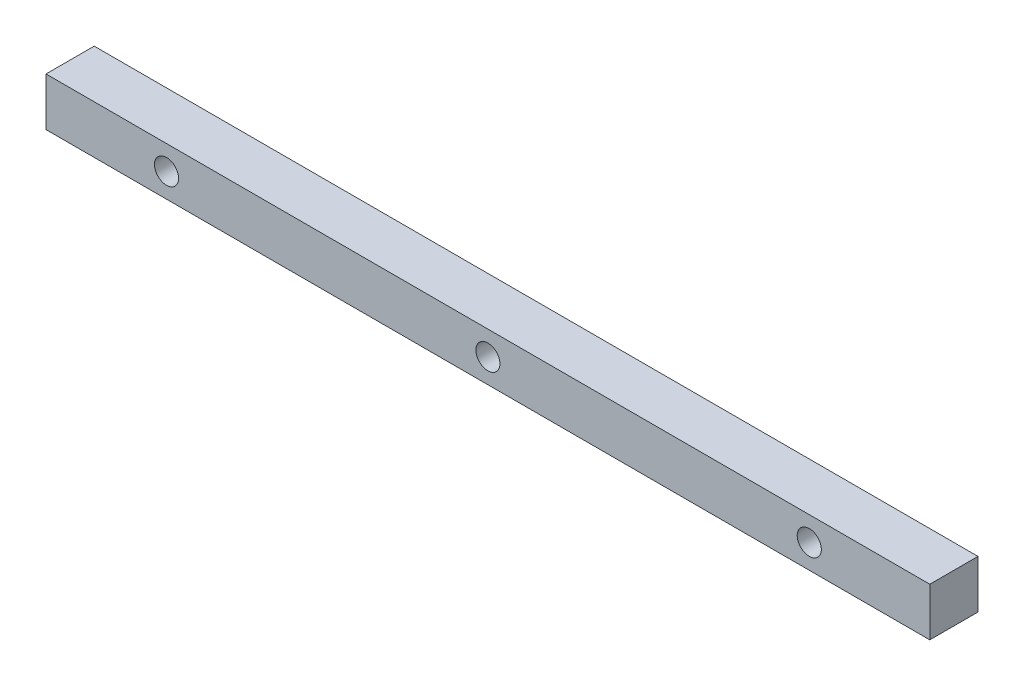
ISO-10303-21;
HEADER;
FILE_DESCRIPTION(('STEP AP214'),'2;1');
FILE_NAME('part.step','',(''),(''),'','','');
FILE_SCHEMA(('AUTOMOTIVE_DESIGN { 1 0 10303 214 1 1 1 1 }'));
ENDSEC;
DATA;
#1=APPLICATION_CONTEXT('core data for automotive mechanical design processes');
#2=APPLICATION_PROTOCOL_DEFINITION('international standard','automotive_design',2000,#1);
#3=PRODUCT_CONTEXT('',#1,'mechanical');
#4=PRODUCT('Part','Part','',(#3));
#5=PRODUCT_RELATED_PRODUCT_CATEGORY('part','',(#4));
#6=PRODUCT_DEFINITION_FORMATION('','',#4);
#7=PRODUCT_DEFINITION_CONTEXT('part definition',#1,'design');
#8=PRODUCT_DEFINITION('design','',#6,#7);
#9=PRODUCT_DEFINITION_SHAPE('','',#8);
#10=(LENGTH_UNIT() NAMED_UNIT(*) SI_UNIT(.MILLI.,.METRE.));
#11=(NAMED_UNIT(*) PLANE_ANGLE_UNIT() SI_UNIT($,.RADIAN.));
#12=(NAMED_UNIT(*) SI_UNIT($,.STERADIAN.) SOLID_ANGLE_UNIT());
#13=UNCERTAINTY_MEASURE_WITH_UNIT(LENGTH_MEASURE(1.E-05),#10,'distance_accuracy_value','');
#14=(GEOMETRIC_REPRESENTATION_CONTEXT(3) GLOBAL_UNCERTAINTY_ASSIGNED_CONTEXT((#13)) GLOBAL_UNIT_ASSIGNED_CONTEXT((#10,
#11,#12)) REPRESENTATION_CONTEXT('',''));
#15=CARTESIAN_POINT('',(0.,0.,0.));
#16=DIRECTION('',(0.,0.,1.));
#17=DIRECTION('',(1.,0.,0.));
#18=AXIS2_PLACEMENT_3D('',#15,#16,#17);
#19=CARTESIAN_POINT('',(-45.4029126213592,16.9902912621359,6.));
#20=DIRECTION('',(1.,0.,0.));
#21=DIRECTION('',(0.,0.,-1.));
#22=AXIS2_PLACEMENT_3D('',#19,#20,#21);
#23=PLANE('',#22);
#24=DIRECTION('',(0.,-1.,0.));
#25=VECTOR('',#24,1.);
#26=CARTESIAN_POINT('',(-45.4029126213592,16.9902912621359,0.));
#27=LINE('',#26,#25);
#28=CARTESIAN_POINT('',(-45.4029126213592,16.9902912621359,0.));
#29=VERTEX_POINT('',#28);
#30=CARTESIAN_POINT('',(-45.4029126213592,10.9902912621359,0.));
#31=VERTEX_POINT('',#30);
#32=EDGE_CURVE('E96',#29,#31,#27,.T.);
#33=ORIENTED_EDGE('',*,*,#32,.T.);
#34=DIRECTION('',(0.,0.,-1.));
#35=VECTOR('',#34,1.);
#36=CARTESIAN_POINT('',(-45.4029126213592,10.9902912621359,6.));
#37=LINE('',#36,#35);
#38=CARTESIAN_POINT('',(-45.4029126213592,10.9902912621359,6.));
#39=VERTEX_POINT('',#38);
#40=EDGE_CURVE('E11',#39,#31,#37,.T.);
#41=ORIENTED_EDGE('',*,*,#40,.F.);
#42=DIRECTION('',(0.,-1.,0.));
#43=VECTOR('',#42,1.);
#44=CARTESIAN_POINT('',(-45.4029126213592,16.9902912621359,6.));
#45=LINE('',#44,#43);
#46=CARTESIAN_POINT('',(-45.4029126213592,16.9902912621359,6.));
#47=VERTEX_POINT('',#46);
#48=EDGE_CURVE('E84',#47,#39,#45,.T.);
#49=ORIENTED_EDGE('',*,*,#48,.F.);
#50=DIRECTION('',(0.,0.,-1.));
#51=VECTOR('',#50,1.);
#52=CARTESIAN_POINT('',(-45.4029126213592,16.9902912621359,6.));
#53=LINE('',#52,#51);
#54=EDGE_CURVE('E92',#47,#29,#53,.T.);
#55=ORIENTED_EDGE('',*,*,#54,.T.);
#56=EDGE_LOOP('',(#33,#41,#49,#55));
#57=FACE_BOUND('',#56,.T.);
#58=ADVANCED_FACE('F33',(#57),#23,.F.);
#59=CARTESIAN_POINT('',(-45.4029126213592,10.9902912621359,6.));
#60=DIRECTION('',(0.,1.,0.));
#61=DIRECTION('',(-1.,0.,0.));
#62=AXIS2_PLACEMENT_3D('',#59,#60,#61);
#63=PLANE('',#62);
#64=DIRECTION('',(1.,0.,0.));
#65=VECTOR('',#64,1.);
#66=CARTESIAN_POINT('',(-45.4029126213592,10.9902912621359,0.));
#67=LINE('',#66,#65);
#68=CARTESIAN_POINT('',(64.5970873786408,10.9902912621359,0.));
#69=VERTEX_POINT('',#68);
#70=EDGE_CURVE('E88',#31,#69,#67,.T.);
#71=ORIENTED_EDGE('',*,*,#70,.T.);
#72=DIRECTION('',(0.,0.,-1.));
#73=VECTOR('',#72,1.);
#74=CARTESIAN_POINT('',(64.5970873786408,10.9902912621359,6.));
#75=LINE('',#74,#73);
#76=CARTESIAN_POINT('',(64.5970873786408,10.9902912621359,6.));
#77=VERTEX_POINT('',#76);
#78=EDGE_CURVE('E41',#77,#69,#75,.T.);
#79=ORIENTED_EDGE('',*,*,#78,.F.);
#80=DIRECTION('',(1.,0.,0.));
#81=VECTOR('',#80,1.);
#82=CARTESIAN_POINT('',(-45.4029126213592,10.9902912621359,6.));
#83=LINE('',#82,#81);
#84=EDGE_CURVE('E79',#39,#77,#83,.T.);
#85=ORIENTED_EDGE('',*,*,#84,.F.);
#86=ORIENTED_EDGE('',*,*,#40,.T.);
#87=EDGE_LOOP('',(#71,#79,#85,#86));
#88=FACE_BOUND('',#87,.T.);
#89=ADVANCED_FACE('F87',(#88),#63,.F.);
#90=CARTESIAN_POINT('',(64.5970873786408,16.9902912621359,6.));
#91=DIRECTION('',(-1.,0.,0.));
#92=DIRECTION('',(0.,0.,1.));
#93=AXIS2_PLACEMENT_3D('',#90,#91,#92);
#94=PLANE('',#93);
#95=DIRECTION('',(0.,1.,0.));
#96=VECTOR('',#95,1.);
#97=CARTESIAN_POINT('',(64.5970873786408,16.9902912621359,0.));
#98=LINE('',#97,#96);
#99=CARTESIAN_POINT('',(64.5970873786408,16.9902912621359,0.));
#100=VERTEX_POINT('',#99);
#101=EDGE_CURVE('E66',#69,#100,#98,.T.);
#102=ORIENTED_EDGE('',*,*,#101,.T.);
#103=DIRECTION('',(0.,0.,-1.));
#104=VECTOR('',#103,1.);
#105=CARTESIAN_POINT('',(64.5970873786408,16.9902912621359,6.));
#106=LINE('',#105,#104);
#107=CARTESIAN_POINT('',(64.5970873786408,16.9902912621359,6.));
#108=VERTEX_POINT('',#107);
#109=EDGE_CURVE('E89',#108,#100,#106,.T.);
#110=ORIENTED_EDGE('',*,*,#109,.F.);
#111=DIRECTION('',(0.,1.,0.));
#112=VECTOR('',#111,1.);
#113=CARTESIAN_POINT('',(64.5970873786408,16.9902912621359,6.));
#114=LINE('',#113,#112);
#115=EDGE_CURVE('E82',#77,#108,#114,.T.);
#116=ORIENTED_EDGE('',*,*,#115,.F.);
#117=ORIENTED_EDGE('',*,*,#78,.T.);
#118=EDGE_LOOP('',(#102,#110,#116,#117));
#119=FACE_BOUND('',#118,.T.);
#120=ADVANCED_FACE('F90',(#119),#94,.F.);
#121=CARTESIAN_POINT('',(-45.4029126213592,16.9902912621359,6.));
#122=DIRECTION('',(0.,-1.,0.));
#123=DIRECTION('',(0.,0.,-1.));
#124=AXIS2_PLACEMENT_3D('',#121,#122,#123);
#125=PLANE('',#124);
#126=DIRECTION('',(-1.,0.,0.));
#127=VECTOR('',#126,1.);
#128=CARTESIAN_POINT('',(-45.4029126213592,16.9902912621359,0.));
#129=LINE('',#128,#127);
#130=EDGE_CURVE('E72',#100,#29,#129,.T.);
#131=ORIENTED_EDGE('',*,*,#130,.T.);
#132=ORIENTED_EDGE('',*,*,#54,.F.);
#133=DIRECTION('',(-1.,0.,0.));
#134=VECTOR('',#133,1.);
#135=CARTESIAN_POINT('',(-45.4029126213592,16.9902912621359,6.));
#136=LINE('',#135,#134);
#137=EDGE_CURVE('E49',#108,#47,#136,.T.);
#138=ORIENTED_EDGE('',*,*,#137,.F.);
#139=ORIENTED_EDGE('',*,*,#109,.T.);
#140=EDGE_LOOP('',(#131,#132,#138,#139));
#141=FACE_BOUND('',#140,.T.);
#142=ADVANCED_FACE('F104',(#141),#125,.F.);
#143=CARTESIAN_POINT('',(0.,0.,6.));
#144=DIRECTION('',(0.,0.,1.));
#145=DIRECTION('',(1.,0.,0.));
#146=AXIS2_PLACEMENT_3D('',#143,#144,#145);
#147=PLANE('',#146);
#148=CARTESIAN_POINT('',(49.5970873786408,13.9902912621359,6.));
#149=DIRECTION('',(0.,0.,1.));
#150=DIRECTION('',(1.,0.,0.));
#151=AXIS2_PLACEMENT_3D('',#148,#149,#150);
#152=CIRCLE('',#151,1.5);
#153=CARTESIAN_POINT('',(51.0970873786408,13.9902912621359,6.));
#154=VERTEX_POINT('',#153);
#155=EDGE_CURVE('E122',#154,#154,#152,.T.);
#156=ORIENTED_EDGE('',*,*,#155,.F.);
#157=EDGE_LOOP('',(#156));
#158=FACE_BOUND('',#157,.T.);
#159=CARTESIAN_POINT('',(9.59708737864076,13.9902912621359,6.));
#160=DIRECTION('',(0.,0.,1.));
#161=DIRECTION('',(1.,0.,0.));
#162=AXIS2_PLACEMENT_3D('',#159,#160,#161);
#163=CIRCLE('',#162,1.5);
#164=CARTESIAN_POINT('',(11.0970873786408,13.9902912621359,6.));
#165=VERTEX_POINT('',#164);
#166=EDGE_CURVE('E116',#165,#165,#163,.T.);
#167=ORIENTED_EDGE('',*,*,#166,.F.);
#168=EDGE_LOOP('',(#167));
#169=FACE_BOUND('',#168,.T.);
#170=CARTESIAN_POINT('',(-30.4029126213592,13.9902912621359,6.));
#171=DIRECTION('',(0.,0.,1.));
#172=DIRECTION('',(1.,0.,0.));
#173=AXIS2_PLACEMENT_3D('',#170,#171,#172);
#174=CIRCLE('',#173,1.5);
#175=CARTESIAN_POINT('',(-28.9029126213592,13.9902912621359,6.));
#176=VERTEX_POINT('',#175);
#177=EDGE_CURVE('E110',#176,#176,#174,.T.);
#178=ORIENTED_EDGE('',*,*,#177,.F.);
#179=EDGE_LOOP('',(#178));
#180=FACE_BOUND('',#179,.T.);
#181=ORIENTED_EDGE('',*,*,#48,.T.);
#182=ORIENTED_EDGE('',*,*,#84,.T.);
#183=ORIENTED_EDGE('',*,*,#115,.T.);
#184=ORIENTED_EDGE('',*,*,#137,.T.);
#185=EDGE_LOOP('',(#181,#182,#183,#184));
#186=FACE_BOUND('',#185,.T.);
#187=ADVANCED_FACE('F80',(#158,#169,#180,#186),#147,.T.);
#188=CARTESIAN_POINT('',(0.,0.,0.));
#189=DIRECTION('',(0.,0.,1.));
#190=DIRECTION('',(1.,0.,0.));
#191=AXIS2_PLACEMENT_3D('',#188,#189,#190);
#192=PLANE('',#191);
#193=ORIENTED_EDGE('',*,*,#32,.F.);
#194=ORIENTED_EDGE('',*,*,#130,.F.);
#195=ORIENTED_EDGE('',*,*,#101,.F.);
#196=ORIENTED_EDGE('',*,*,#70,.F.);
#197=EDGE_LOOP('',(#193,#194,#195,#196));
#198=FACE_BOUND('',#197,.T.);
#199=ADVANCED_FACE('F107',(#198),#192,.F.);
#200=CARTESIAN_POINT('',(-30.4029126213592,13.9902912621359,3.));
#201=DIRECTION('',(0.,0.,1.));
#202=DIRECTION('',(1.,0.,0.));
#203=AXIS2_PLACEMENT_3D('',#200,#201,#202);
#204=CYLINDRICAL_SURFACE('',#203,1.5);
#205=CARTESIAN_POINT('',(-30.4029126213592,13.9902912621359,3.));
#206=DIRECTION('',(0.,0.,1.));
#207=DIRECTION('',(1.,0.,0.));
#208=AXIS2_PLACEMENT_3D('',#205,#206,#207);
#209=CIRCLE('',#208,1.5);
#210=CARTESIAN_POINT('',(-28.9029126213592,13.9902912621359,3.));
#211=VERTEX_POINT('',#210);
#212=EDGE_CURVE('E99',#211,#211,#209,.T.);
#213=ORIENTED_EDGE('',*,*,#212,.F.);
#214=EDGE_LOOP('',(#213));
#215=FACE_BOUND('',#214,.T.);
#216=ORIENTED_EDGE('',*,*,#177,.T.);
#217=EDGE_LOOP('',(#216));
#218=FACE_BOUND('',#217,.T.);
#219=ADVANCED_FACE('F144',(#215,#218),#204,.F.);
#220=CARTESIAN_POINT('',(-30.4029126213592,13.9902912621359,3.));
#221=DIRECTION('',(0.,0.,1.));
#222=DIRECTION('',(1.,0.,0.));
#223=AXIS2_PLACEMENT_3D('',#220,#221,#222);
#224=PLANE('',#223);
#225=ORIENTED_EDGE('',*,*,#212,.T.);
#226=EDGE_LOOP('',(#225));
#227=FACE_BOUND('',#226,.T.);
#228=ADVANCED_FACE('F146',(#227),#224,.T.);
#229=CARTESIAN_POINT('',(9.59708737864076,13.9902912621359,3.));
#230=DIRECTION('',(0.,0.,1.));
#231=DIRECTION('',(1.,0.,0.));
#232=AXIS2_PLACEMENT_3D('',#229,#230,#231);
#233=CYLINDRICAL_SURFACE('',#232,1.5);
#234=CARTESIAN_POINT('',(9.59708737864076,13.9902912621359,3.));
#235=DIRECTION('',(0.,0.,1.));
#236=DIRECTION('',(1.,0.,0.));
#237=AXIS2_PLACEMENT_3D('',#234,#235,#236);
#238=CIRCLE('',#237,1.5);
#239=CARTESIAN_POINT('',(11.0970873786408,13.9902912621359,3.));
#240=VERTEX_POINT('',#239);
#241=EDGE_CURVE('E113',#240,#240,#238,.T.);
#242=ORIENTED_EDGE('',*,*,#241,.F.);
#243=EDGE_LOOP('',(#242));
#244=FACE_BOUND('',#243,.T.);
#245=ORIENTED_EDGE('',*,*,#166,.T.);
#246=EDGE_LOOP('',(#245));
#247=FACE_BOUND('',#246,.T.);
#248=ADVANCED_FACE('F153',(#244,#247),#233,.F.);
#249=CARTESIAN_POINT('',(9.59708737864076,13.9902912621359,3.));
#250=DIRECTION('',(0.,0.,1.));
#251=DIRECTION('',(1.,0.,0.));
#252=AXIS2_PLACEMENT_3D('',#249,#250,#251);
#253=PLANE('',#252);
#254=ORIENTED_EDGE('',*,*,#241,.T.);
#255=EDGE_LOOP('',(#254));
#256=FACE_BOUND('',#255,.T.);
#257=ADVANCED_FACE('F133',(#256),#253,.T.);
#258=CARTESIAN_POINT('',(49.5970873786408,13.9902912621359,3.));
#259=DIRECTION('',(0.,0.,1.));
#260=DIRECTION('',(1.,0.,0.));
#261=AXIS2_PLACEMENT_3D('',#258,#259,#260);
#262=CYLINDRICAL_SURFACE('',#261,1.5);
#263=CARTESIAN_POINT('',(49.5970873786408,13.9902912621359,3.));
#264=DIRECTION('',(0.,0.,1.));
#265=DIRECTION('',(1.,0.,0.));
#266=AXIS2_PLACEMENT_3D('',#263,#264,#265);
#267=CIRCLE('',#266,1.5);
#268=CARTESIAN_POINT('',(51.0970873786408,13.9902912621359,3.));
#269=VERTEX_POINT('',#268);
#270=EDGE_CURVE('E119',#269,#269,#267,.T.);
#271=ORIENTED_EDGE('',*,*,#270,.F.);
#272=EDGE_LOOP('',(#271));
#273=FACE_BOUND('',#272,.T.);
#274=ORIENTED_EDGE('',*,*,#155,.T.);
#275=EDGE_LOOP('',(#274));
#276=FACE_BOUND('',#275,.T.);
#277=ADVANCED_FACE('F130',(#273,#276),#262,.F.);
#278=CARTESIAN_POINT('',(49.5970873786408,13.9902912621359,3.));
#279=DIRECTION('',(0.,0.,1.));
#280=DIRECTION('',(1.,0.,0.));
#281=AXIS2_PLACEMENT_3D('',#278,#279,#280);
#282=PLANE('',#281);
#283=ORIENTED_EDGE('',*,*,#270,.T.);
#284=EDGE_LOOP('',(#283));
#285=FACE_BOUND('',#284,.T.);
#286=ADVANCED_FACE('F128',(#285),#282,.T.);
#287=CLOSED_SHELL('',(#58,#89,#120,#142,#187,#199,#219,#228,#248,#257,#277,#286));
#288=MANIFOLD_SOLID_BREP('B2',#287);
#289=ADVANCED_BREP_SHAPE_REPRESENTATION('',(#18,#288),#14);
#290=SHAPE_DEFINITION_REPRESENTATION(#9,#289);
ENDSEC;
END-ISO-10303-21;
